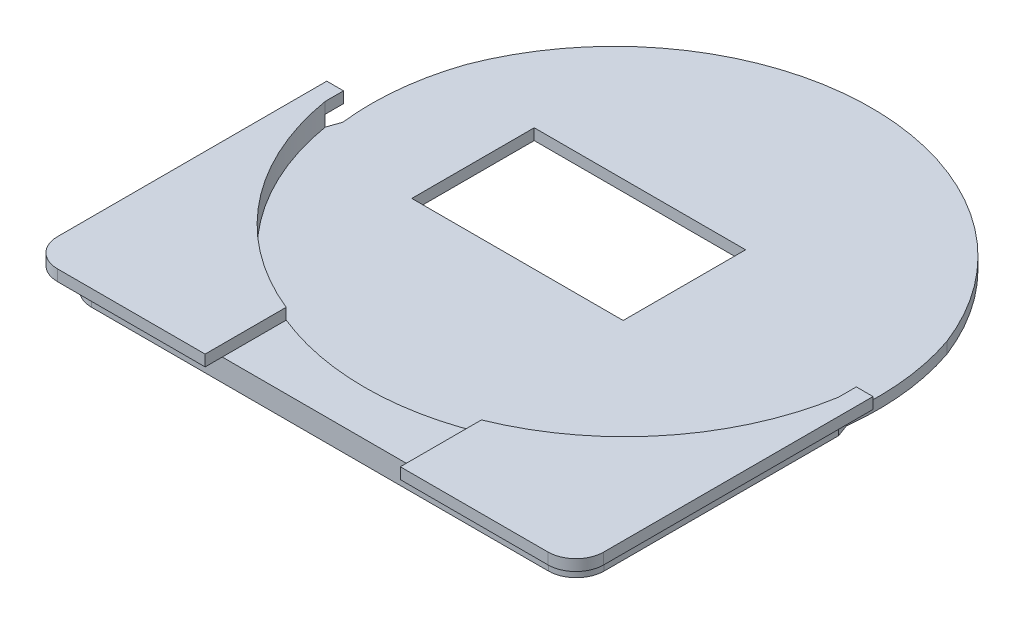
ISO-10303-21;
HEADER;
FILE_DESCRIPTION(('STEP AP214'),'2;1');
FILE_NAME('part.step','',(''),(''),'','','');
FILE_SCHEMA(('AUTOMOTIVE_DESIGN { 1 0 10303 214 1 1 1 1 }'));
ENDSEC;
DATA;
#1=APPLICATION_CONTEXT('core data for automotive mechanical design processes');
#2=APPLICATION_PROTOCOL_DEFINITION('international standard','automotive_design',2000,#1);
#3=PRODUCT_CONTEXT('',#1,'mechanical');
#4=PRODUCT('Part','Part','',(#3));
#5=PRODUCT_RELATED_PRODUCT_CATEGORY('part','',(#4));
#6=PRODUCT_DEFINITION_FORMATION('','',#4);
#7=PRODUCT_DEFINITION_CONTEXT('part definition',#1,'design');
#8=PRODUCT_DEFINITION('design','',#6,#7);
#9=PRODUCT_DEFINITION_SHAPE('','',#8);
#10=(LENGTH_UNIT() NAMED_UNIT(*) SI_UNIT(.MILLI.,.METRE.));
#11=(NAMED_UNIT(*) PLANE_ANGLE_UNIT() SI_UNIT($,.RADIAN.));
#12=(NAMED_UNIT(*) SI_UNIT($,.STERADIAN.) SOLID_ANGLE_UNIT());
#13=UNCERTAINTY_MEASURE_WITH_UNIT(LENGTH_MEASURE(1.E-05),#10,'distance_accuracy_value','');
#14=(GEOMETRIC_REPRESENTATION_CONTEXT(3) GLOBAL_UNCERTAINTY_ASSIGNED_CONTEXT((#13)) GLOBAL_UNIT_ASSIGNED_CONTEXT((#10,
#11,#12)) REPRESENTATION_CONTEXT('',''));
#15=CARTESIAN_POINT('',(0.,0.,0.));
#16=DIRECTION('',(0.,0.,1.));
#17=DIRECTION('',(1.,0.,0.));
#18=AXIS2_PLACEMENT_3D('',#15,#16,#17);
#19=CARTESIAN_POINT('',(-102.035735829472,4.,45.8580425502869));
#20=DIRECTION('',(0.,1.,0.));
#21=DIRECTION('',(0.,0.,1.));
#22=AXIS2_PLACEMENT_3D('',#19,#20,#21);
#23=PLANE('',#22);
#24=DIRECTION('',(1.,0.,0.));
#25=VECTOR('',#24,1.);
#26=CARTESIAN_POINT('',(-102.035735829472,4.,50.8580425502869));
#27=LINE('',#26,#25);
#28=CARTESIAN_POINT('',(-78.5477078121989,4.,50.8580425502869));
#29=VERTEX_POINT('',#28);
#30=CARTESIAN_POINT('',(-43.5307751661155,4.,50.8580425502869));
#31=VERTEX_POINT('',#30);
#32=EDGE_CURVE('E392',#29,#31,#27,.T.);
#33=ORIENTED_EDGE('',*,*,#32,.T.);
#34=DIRECTION('',(0.,0.,1.));
#35=VECTOR('',#34,1.);
#36=CARTESIAN_POINT('',(-43.5307751661155,4.,53.9393128759553));
#37=LINE('',#36,#35);
#38=CARTESIAN_POINT('',(-43.5307751661155,4.,39.3922849965716));
#39=VERTEX_POINT('',#38);
#40=EDGE_CURVE('E808',#39,#31,#37,.T.);
#41=ORIENTED_EDGE('',*,*,#40,.F.);
#42=CARTESIAN_POINT('',(-61.0392414891572,4.,-3.84195744971311));
#43=DIRECTION('',(0.,1.,0.));
#44=DIRECTION('',(0.,0.,1.));
#45=AXIS2_PLACEMENT_3D('',#42,#43,#44);
#46=CIRCLE('',#45,46.6448937493614);
#47=CARTESIAN_POINT('',(-78.5477078121989,4.,39.3922849965716));
#48=VERTEX_POINT('',#47);
#49=EDGE_CURVE('E366',#48,#39,#46,.T.);
#50=ORIENTED_EDGE('',*,*,#49,.F.);
#51=DIRECTION('',(0.,0.,-1.));
#52=VECTOR('',#51,1.);
#53=CARTESIAN_POINT('',(-78.5477078121989,4.,53.9393128759553));
#54=LINE('',#53,#52);
#55=EDGE_CURVE('E11',#29,#48,#54,.T.);
#56=ORIENTED_EDGE('',*,*,#55,.F.);
#57=EDGE_LOOP('',(#33,#41,#50,#56));
#58=FACE_BOUND('',#57,.T.);
#59=ADVANCED_FACE('F37',(#58),#23,.T.);
#60=CARTESIAN_POINT('',(-61.0357358294719,0.,-1.9398449355949));
#61=DIRECTION('',(0.,1.,0.));
#62=DIRECTION('',(0.,0.,1.));
#63=AXIS2_PLACEMENT_3D('',#60,#61,#62);
#64=CYLINDRICAL_SURFACE('',#63,46.1488583159595);
#65=DIRECTION('',(0.,1.,0.));
#66=VECTOR('',#65,1.);
#67=CARTESIAN_POINT('',(-104.132740842369,-3.,-18.4433379835776));
#68=LINE('',#67,#66);
#69=CARTESIAN_POINT('',(-104.132740842369,2.,-18.4433379835776));
#70=VERTEX_POINT('',#69);
#71=CARTESIAN_POINT('',(-104.132740842369,0.,-18.4433379835776));
#72=VERTEX_POINT('',#71);
#73=EDGE_CURVE('E335',#70,#72,#68,.F.);
#74=ORIENTED_EDGE('',*,*,#73,.F.);
#75=CARTESIAN_POINT('',(-61.0357358294719,2.,-1.9398449355949));
#76=DIRECTION('',(0.,1.,0.));
#77=DIRECTION('',(0.,0.,1.));
#78=AXIS2_PLACEMENT_3D('',#75,#76,#77);
#79=CIRCLE('',#78,46.1488583159595);
#80=CARTESIAN_POINT('',(-17.9998564170638,2.,-18.6020838928051));
#81=VERTEX_POINT('',#80);
#82=EDGE_CURVE('E425',#81,#70,#79,.T.);
#83=ORIENTED_EDGE('',*,*,#82,.F.);
#84=DIRECTION('',(0.,1.,0.));
#85=VECTOR('',#84,1.);
#86=CARTESIAN_POINT('',(-17.9998564170638,-3.,-18.6020838928051));
#87=LINE('',#86,#85);
#88=CARTESIAN_POINT('',(-17.9998564170638,0.,-18.6020838928051));
#89=VERTEX_POINT('',#88);
#90=EDGE_CURVE('E338',#89,#81,#87,.T.);
#91=ORIENTED_EDGE('',*,*,#90,.F.);
#92=CARTESIAN_POINT('',(-61.0357358294719,0.,-1.9398449355949));
#93=DIRECTION('',(0.,1.,0.));
#94=DIRECTION('',(0.,0.,1.));
#95=AXIS2_PLACEMENT_3D('',#92,#93,#94);
#96=CIRCLE('',#95,46.1488583159595);
#97=EDGE_CURVE('E422',#72,#89,#96,.F.);
#98=ORIENTED_EDGE('',*,*,#97,.F.);
#99=EDGE_LOOP('',(#74,#83,#91,#98));
#100=FACE_BOUND('',#99,.T.);
#101=ADVANCED_FACE('F445',(#100),#64,.T.);
#102=CARTESIAN_POINT('',(-102.035735829472,0.,45.8580425502869));
#103=DIRECTION('',(0.,1.,0.));
#104=DIRECTION('',(0.,0.,1.));
#105=AXIS2_PLACEMENT_3D('',#102,#103,#104);
#106=PLANE('',#105);
#107=DIRECTION('',(1.,0.,0.));
#108=VECTOR('',#107,1.);
#109=CARTESIAN_POINT('',(-50.2680723261196,0.,7.2220291908083));
#110=LINE('',#109,#108);
#111=CARTESIAN_POINT('',(-88.1898360293224,0.,7.2220291908083));
#112=VERTEX_POINT('',#111);
#113=CARTESIAN_POINT('',(-50.2680723261196,0.,7.2220291908083));
#114=VERTEX_POINT('',#113);
#115=EDGE_CURVE('E351',#112,#114,#110,.T.);
#116=ORIENTED_EDGE('',*,*,#115,.T.);
#117=DIRECTION('',(0.,0.,-1.));
#118=VECTOR('',#117,1.);
#119=CARTESIAN_POINT('',(-50.2680723261196,0.,-14.7440043560306));
#120=LINE('',#119,#118);
#121=CARTESIAN_POINT('',(-50.2680723261196,0.,-14.7440043560306));
#122=VERTEX_POINT('',#121);
#123=EDGE_CURVE('E341',#114,#122,#120,.T.);
#124=ORIENTED_EDGE('',*,*,#123,.T.);
#125=DIRECTION('',(-1.,0.,0.));
#126=VECTOR('',#125,1.);
#127=CARTESIAN_POINT('',(-50.2680723261196,0.,-14.7440043560306));
#128=LINE('',#127,#126);
#129=CARTESIAN_POINT('',(-88.1898360293224,0.,-14.7440043560306));
#130=VERTEX_POINT('',#129);
#131=EDGE_CURVE('E344',#122,#130,#128,.T.);
#132=ORIENTED_EDGE('',*,*,#131,.T.);
#133=DIRECTION('',(0.,0.,1.));
#134=VECTOR('',#133,1.);
#135=CARTESIAN_POINT('',(-88.1898360293224,0.,-14.7440043560306));
#136=LINE('',#135,#134);
#137=EDGE_CURVE('E348',#130,#112,#136,.T.);
#138=ORIENTED_EDGE('',*,*,#137,.T.);
#139=EDGE_LOOP('',(#116,#124,#132,#138));
#140=FACE_BOUND('',#139,.T.);
#141=CARTESIAN_POINT('',(-61.0392414891572,0.,-3.84195744971311));
#142=DIRECTION('',(0.,1.,0.));
#143=DIRECTION('',(0.,0.,1.));
#144=AXIS2_PLACEMENT_3D('',#141,#142,#143);
#145=CIRCLE('',#144,45.5);
#146=CARTESIAN_POINT('',(-106.217317024172,0.,1.56095759241559));
#147=VERTEX_POINT('',#146);
#148=EDGE_CURVE('E333',#72,#147,#145,.T.);
#149=ORIENTED_EDGE('',*,*,#148,.F.);
#150=ORIENTED_EDGE('',*,*,#97,.T.);
#151=CARTESIAN_POINT('',(-15.861165954142,0.,1.56095759241558));
#152=VERTEX_POINT('',#151);
#153=EDGE_CURVE('E336',#152,#89,#145,.T.);
#154=ORIENTED_EDGE('',*,*,#153,.F.);
#155=DIRECTION('',(0.343698835821301,0.,0.939079927511542));
#156=VECTOR('',#155,1.);
#157=CARTESIAN_POINT('',(-11.743515050915,0.,12.8115145007046));
#158=LINE('',#157,#156);
#159=CARTESIAN_POINT('',(-15.0357358294719,0.,3.81626014468849));
#160=VERTEX_POINT('',#159);
#161=EDGE_CURVE('E322',#152,#160,#158,.T.);
#162=ORIENTED_EDGE('',*,*,#161,.T.);
#163=DIRECTION('',(0.,0.,-1.));
#164=VECTOR('',#163,1.);
#165=CARTESIAN_POINT('',(-15.0357358294719,0.,-49.1419574497131));
#166=LINE('',#165,#164);
#167=CARTESIAN_POINT('',(-15.0357358294719,0.,45.8580425502868));
#168=VERTEX_POINT('',#167);
#169=EDGE_CURVE('E389',#168,#160,#166,.T.);
#170=ORIENTED_EDGE('',*,*,#169,.F.);
#171=CARTESIAN_POINT('',(-20.0357358294719,0.,45.8580425502869));
#172=DIRECTION('',(0.,1.,0.));
#173=DIRECTION('',(0.,0.,1.));
#174=AXIS2_PLACEMENT_3D('',#171,#172,#173);
#175=CIRCLE('',#174,5.);
#176=CARTESIAN_POINT('',(-20.035735829472,0.,50.8580425502869));
#177=VERTEX_POINT('',#176);
#178=EDGE_CURVE('E407',#177,#168,#175,.T.);
#179=ORIENTED_EDGE('',*,*,#178,.F.);
#180=DIRECTION('',(1.,0.,0.));
#181=VECTOR('',#180,1.);
#182=CARTESIAN_POINT('',(-102.035735829472,0.,50.8580425502869));
#183=LINE('',#182,#181);
#184=CARTESIAN_POINT('',(-102.035735829472,0.,50.8580425502869));
#185=VERTEX_POINT('',#184);
#186=EDGE_CURVE('E405',#185,#177,#183,.T.);
#187=ORIENTED_EDGE('',*,*,#186,.F.);
#188=CARTESIAN_POINT('',(-102.035735829472,0.,45.8580425502869));
#189=DIRECTION('',(0.,1.,0.));
#190=DIRECTION('',(0.,0.,1.));
#191=AXIS2_PLACEMENT_3D('',#188,#189,#190);
#192=CIRCLE('',#191,5.);
#193=CARTESIAN_POINT('',(-107.035735829472,0.,45.8580425502868));
#194=VERTEX_POINT('',#193);
#195=EDGE_CURVE('E403',#194,#185,#192,.T.);
#196=ORIENTED_EDGE('',*,*,#195,.F.);
#197=DIRECTION('',(0.,0.,1.));
#198=VECTOR('',#197,1.);
#199=CARTESIAN_POINT('',(-107.035735829472,0.,-49.1419574497131));
#200=LINE('',#199,#198);
#201=CARTESIAN_POINT('',(-107.035735829472,0.,3.90843746220008));
#202=VERTEX_POINT('',#201);
#203=EDGE_CURVE('E384',#202,#194,#200,.T.);
#204=ORIENTED_EDGE('',*,*,#203,.F.);
#205=DIRECTION('',(-0.329203777971666,0.,0.944258901239052));
#206=VECTOR('',#205,1.);
#207=CARTESIAN_POINT('',(-119.534045854839,0.,39.7574807648366));
#208=LINE('',#207,#206);
#209=EDGE_CURVE('E331',#147,#202,#208,.T.);
#210=ORIENTED_EDGE('',*,*,#209,.F.);
#211=EDGE_LOOP('',(#149,#150,#154,#162,#170,#179,#187,#196,#204,#210));
#212=FACE_BOUND('',#211,.T.);
#213=ADVANCED_FACE('F449',(#140,#212),#106,.F.);
#214=CARTESIAN_POINT('',(-107.035735829472,4.,-49.1419574497131));
#215=DIRECTION('',(1.,0.,0.));
#216=DIRECTION('',(0.,0.,-1.));
#217=AXIS2_PLACEMENT_3D('',#214,#215,#216);
#218=PLANE('',#217);
#219=DIRECTION('',(0.,1.,0.));
#220=VECTOR('',#219,1.);
#221=CARTESIAN_POINT('',(-107.035735829472,-8.,3.90843746220008));
#222=LINE('',#221,#220);
#223=CARTESIAN_POINT('',(-107.035735829472,2.,3.90843746220009));
#224=VERTEX_POINT('',#223);
#225=EDGE_CURVE('E323',#202,#224,#222,.T.);
#226=ORIENTED_EDGE('',*,*,#225,.F.);
#227=ORIENTED_EDGE('',*,*,#203,.T.);
#228=DIRECTION('',(0.,-1.,0.));
#229=VECTOR('',#228,1.);
#230=CARTESIAN_POINT('',(-107.035735829472,4.,45.8580425502868));
#231=LINE('',#230,#229);
#232=CARTESIAN_POINT('',(-107.035735829472,4.,45.8580425502868));
#233=VERTEX_POINT('',#232);
#234=EDGE_CURVE('E419',#233,#194,#231,.T.);
#235=ORIENTED_EDGE('',*,*,#234,.F.);
#236=DIRECTION('',(0.,0.,1.));
#237=VECTOR('',#236,1.);
#238=CARTESIAN_POINT('',(-107.035735829472,4.,-49.1419574497131));
#239=LINE('',#238,#237);
#240=CARTESIAN_POINT('',(-107.035735829472,4.,3.90843746220009));
#241=VERTEX_POINT('',#240);
#242=EDGE_CURVE('E385',#241,#233,#239,.T.);
#243=ORIENTED_EDGE('',*,*,#242,.F.);
#244=DIRECTION('',(0.,1.,0.));
#245=VECTOR('',#244,1.);
#246=CARTESIAN_POINT('',(-107.035735829472,2.,3.90843746220009));
#247=LINE('',#246,#245);
#248=EDGE_CURVE('E381',#241,#224,#247,.F.);
#249=ORIENTED_EDGE('',*,*,#248,.T.);
#250=EDGE_LOOP('',(#226,#227,#235,#243,#249));
#251=FACE_BOUND('',#250,.T.);
#252=ADVANCED_FACE('F39',(#251),#218,.F.);
#253=CARTESIAN_POINT('',(-61.0392414891572,2.,-3.84195744971311));
#254=DIRECTION('',(0.,1.,0.));
#255=DIRECTION('',(0.,0.,1.));
#256=AXIS2_PLACEMENT_3D('',#253,#254,#255);
#257=PLANE('',#256);
#258=DIRECTION('',(0.,0.,-1.));
#259=VECTOR('',#258,1.);
#260=CARTESIAN_POINT('',(-50.2680723261196,2.,-14.7440043560306));
#261=LINE('',#260,#259);
#262=CARTESIAN_POINT('',(-50.2680723261196,2.,7.2220291908083));
#263=VERTEX_POINT('',#262);
#264=CARTESIAN_POINT('',(-50.2680723261196,2.,-14.7440043560306));
#265=VERTEX_POINT('',#264);
#266=EDGE_CURVE('E340',#263,#265,#261,.T.);
#267=ORIENTED_EDGE('',*,*,#266,.F.);
#268=DIRECTION('',(1.,0.,0.));
#269=VECTOR('',#268,1.);
#270=CARTESIAN_POINT('',(-50.2680723261196,2.,7.2220291908083));
#271=LINE('',#270,#269);
#272=CARTESIAN_POINT('',(-88.1898360293224,2.,7.2220291908083));
#273=VERTEX_POINT('',#272);
#274=EDGE_CURVE('E345',#273,#263,#271,.T.);
#275=ORIENTED_EDGE('',*,*,#274,.F.);
#276=DIRECTION('',(0.,0.,1.));
#277=VECTOR('',#276,1.);
#278=CARTESIAN_POINT('',(-88.1898360293224,2.,-14.7440043560306));
#279=LINE('',#278,#277);
#280=CARTESIAN_POINT('',(-88.1898360293224,2.,-14.7440043560306));
#281=VERTEX_POINT('',#280);
#282=EDGE_CURVE('E359',#281,#273,#279,.T.);
#283=ORIENTED_EDGE('',*,*,#282,.F.);
#284=DIRECTION('',(-1.,0.,0.));
#285=VECTOR('',#284,1.);
#286=CARTESIAN_POINT('',(-50.2680723261196,2.,-14.7440043560306));
#287=LINE('',#286,#285);
#288=EDGE_CURVE('E356',#265,#281,#287,.T.);
#289=ORIENTED_EDGE('',*,*,#288,.F.);
#290=EDGE_LOOP('',(#267,#275,#283,#289));
#291=FACE_BOUND('',#290,.T.);
#292=ORIENTED_EDGE('',*,*,#82,.T.);
#293=CARTESIAN_POINT('',(-61.0392414891572,2.,-3.84195744971311));
#294=DIRECTION('',(0.,1.,0.));
#295=DIRECTION('',(0.,0.,1.));
#296=AXIS2_PLACEMENT_3D('',#293,#294,#295);
#297=CIRCLE('',#296,45.5);
#298=CARTESIAN_POINT('',(-106.217317024172,2.,1.56095759241559));
#299=VERTEX_POINT('',#298);
#300=EDGE_CURVE('E41',#70,#299,#297,.T.);
#301=ORIENTED_EDGE('',*,*,#300,.T.);
#302=DIRECTION('',(-0.329203777971666,0.,0.944258901239052));
#303=VECTOR('',#302,1.);
#304=CARTESIAN_POINT('',(-94.2207724729035,2.,-32.8488661539617));
#305=LINE('',#304,#303);
#306=EDGE_CURVE('E316',#299,#224,#305,.T.);
#307=ORIENTED_EDGE('',*,*,#306,.T.);
#308=CARTESIAN_POINT('',(-61.0392414891572,2.,-3.84195744971311));
#309=DIRECTION('',(0.,1.,0.));
#310=DIRECTION('',(0.,0.,1.));
#311=AXIS2_PLACEMENT_3D('',#308,#309,#310);
#312=CIRCLE('',#311,46.6448937493614);
#313=CARTESIAN_POINT('',(-15.0357358294719,2.,3.86671169019128));
#314=VERTEX_POINT('',#313);
#315=EDGE_CURVE('E373',#224,#314,#312,.T.);
#316=ORIENTED_EDGE('',*,*,#315,.T.);
#317=DIRECTION('',(0.,0.,-1.));
#318=VECTOR('',#317,1.);
#319=CARTESIAN_POINT('',(-15.0357358294719,2.,-49.1419574497131));
#320=LINE('',#319,#318);
#321=CARTESIAN_POINT('',(-15.0357358294719,2.,3.81626014468849));
#322=VERTEX_POINT('',#321);
#323=EDGE_CURVE('E376',#314,#322,#320,.T.);
#324=ORIENTED_EDGE('',*,*,#323,.T.);
#325=DIRECTION('',(0.343698835821301,0.,0.939079927511542));
#326=VECTOR('',#325,1.);
#327=CARTESIAN_POINT('',(-14.4913197605095,2.,5.303754861846));
#328=LINE('',#327,#326);
#329=CARTESIAN_POINT('',(-15.861165954142,2.,1.56095759241558));
#330=VERTEX_POINT('',#329);
#331=EDGE_CURVE('E314',#330,#322,#328,.T.);
#332=ORIENTED_EDGE('',*,*,#331,.F.);
#333=CARTESIAN_POINT('',(-61.0392414891572,2.,-3.84195744971311));
#334=DIRECTION('',(0.,1.,0.));
#335=DIRECTION('',(0.,0.,1.));
#336=AXIS2_PLACEMENT_3D('',#333,#334,#335);
#337=CIRCLE('',#336,45.5);
#338=EDGE_CURVE('E60',#330,#81,#337,.T.);
#339=ORIENTED_EDGE('',*,*,#338,.T.);
#340=EDGE_LOOP('',(#292,#301,#307,#316,#324,#332,#339));
#341=FACE_BOUND('',#340,.T.);
#342=ADVANCED_FACE('F434',(#291,#341),#257,.T.);
#343=CARTESIAN_POINT('',(-102.035735829472,4.,45.8580425502869));
#344=DIRECTION('',(0.,-1.,0.));
#345=DIRECTION('',(0.,0.,-1.));
#346=AXIS2_PLACEMENT_3D('',#343,#344,#345);
#347=CYLINDRICAL_SURFACE('',#346,5.);
#348=ORIENTED_EDGE('',*,*,#195,.T.);
#349=DIRECTION('',(0.,-1.,0.));
#350=VECTOR('',#349,1.);
#351=CARTESIAN_POINT('',(-102.035735829472,4.,50.8580425502869));
#352=LINE('',#351,#350);
#353=CARTESIAN_POINT('',(-102.035735829472,4.,50.8580425502869));
#354=VERTEX_POINT('',#353);
#355=EDGE_CURVE('E416',#354,#185,#352,.T.);
#356=ORIENTED_EDGE('',*,*,#355,.F.);
#357=CARTESIAN_POINT('',(-102.035735829472,4.,45.8580425502869));
#358=DIRECTION('',(0.,1.,0.));
#359=DIRECTION('',(0.,0.,1.));
#360=AXIS2_PLACEMENT_3D('',#357,#358,#359);
#361=CIRCLE('',#360,5.);
#362=EDGE_CURVE('E388',#233,#354,#361,.T.);
#363=ORIENTED_EDGE('',*,*,#362,.F.);
#364=ORIENTED_EDGE('',*,*,#234,.T.);
#365=EDGE_LOOP('',(#348,#356,#363,#364));
#366=FACE_BOUND('',#365,.T.);
#367=ADVANCED_FACE('F462',(#366),#347,.T.);
#368=CARTESIAN_POINT('',(-102.035735829472,4.,50.8580425502869));
#369=DIRECTION('',(0.,0.,-1.));
#370=DIRECTION('',(-1.,0.,0.));
#371=AXIS2_PLACEMENT_3D('',#368,#369,#370);
#372=PLANE('',#371);
#373=ORIENTED_EDGE('',*,*,#186,.T.);
#374=DIRECTION('',(0.,-1.,0.));
#375=VECTOR('',#374,1.);
#376=CARTESIAN_POINT('',(-20.035735829472,4.,50.8580425502869));
#377=LINE('',#376,#375);
#378=CARTESIAN_POINT('',(-20.0357358294719,4.,50.8580425502869));
#379=VERTEX_POINT('',#378);
#380=EDGE_CURVE('E413',#379,#177,#377,.T.);
#381=ORIENTED_EDGE('',*,*,#380,.F.);
#382=DIRECTION('',(1.,0.,0.));
#383=VECTOR('',#382,1.);
#384=CARTESIAN_POINT('',(-102.035735829472,4.,50.8580425502869));
#385=LINE('',#384,#383);
#386=EDGE_CURVE('E258',#31,#379,#385,.T.);
#387=ORIENTED_EDGE('',*,*,#386,.F.);
#388=ORIENTED_EDGE('',*,*,#32,.F.);
#389=EDGE_CURVE('E393',#354,#29,#27,.T.);
#390=ORIENTED_EDGE('',*,*,#389,.F.);
#391=ORIENTED_EDGE('',*,*,#355,.T.);
#392=EDGE_LOOP('',(#373,#381,#387,#388,#390,#391));
#393=FACE_BOUND('',#392,.T.);
#394=ADVANCED_FACE('F504',(#393),#372,.F.);
#395=CARTESIAN_POINT('',(-20.0357358294719,4.,45.8580425502869));
#396=DIRECTION('',(0.,-1.,0.));
#397=DIRECTION('',(0.,0.,-1.));
#398=AXIS2_PLACEMENT_3D('',#395,#396,#397);
#399=CYLINDRICAL_SURFACE('',#398,5.);
#400=ORIENTED_EDGE('',*,*,#178,.T.);
#401=DIRECTION('',(0.,-1.,0.));
#402=VECTOR('',#401,1.);
#403=CARTESIAN_POINT('',(-15.0357358294719,4.,45.8580425502868));
#404=LINE('',#403,#402);
#405=CARTESIAN_POINT('',(-15.0357358294719,4.,45.8580425502869));
#406=VERTEX_POINT('',#405);
#407=EDGE_CURVE('E401',#406,#168,#404,.T.);
#408=ORIENTED_EDGE('',*,*,#407,.F.);
#409=CARTESIAN_POINT('',(-20.0357358294719,4.,45.8580425502869));
#410=DIRECTION('',(0.,1.,0.));
#411=DIRECTION('',(0.,0.,1.));
#412=AXIS2_PLACEMENT_3D('',#409,#410,#411);
#413=CIRCLE('',#412,5.);
#414=EDGE_CURVE('E396',#379,#406,#413,.T.);
#415=ORIENTED_EDGE('',*,*,#414,.F.);
#416=ORIENTED_EDGE('',*,*,#380,.T.);
#417=EDGE_LOOP('',(#400,#408,#415,#416));
#418=FACE_BOUND('',#417,.T.);
#419=ADVANCED_FACE('F493',(#418),#399,.T.);
#420=CARTESIAN_POINT('',(-15.0357358294719,4.,-49.1419574497131));
#421=DIRECTION('',(-1.,0.,0.));
#422=DIRECTION('',(0.,0.,1.));
#423=AXIS2_PLACEMENT_3D('',#420,#421,#422);
#424=PLANE('',#423);
#425=ORIENTED_EDGE('',*,*,#169,.T.);
#426=DIRECTION('',(0.,1.,0.));
#427=VECTOR('',#426,1.);
#428=CARTESIAN_POINT('',(-15.0357358294719,-8.,3.81626014468849));
#429=LINE('',#428,#427);
#430=EDGE_CURVE('E325',#160,#322,#429,.T.);
#431=ORIENTED_EDGE('',*,*,#430,.T.);
#432=ORIENTED_EDGE('',*,*,#323,.F.);
#433=DIRECTION('',(0.,1.,0.));
#434=VECTOR('',#433,1.);
#435=CARTESIAN_POINT('',(-15.0357358294719,2.,3.86671169019128));
#436=LINE('',#435,#434);
#437=CARTESIAN_POINT('',(-15.0357358294719,4.,3.86671169019128));
#438=VERTEX_POINT('',#437);
#439=EDGE_CURVE('E427',#314,#438,#436,.T.);
#440=ORIENTED_EDGE('',*,*,#439,.T.);
#441=DIRECTION('',(0.,0.,-1.));
#442=VECTOR('',#441,1.);
#443=CARTESIAN_POINT('',(-15.0357358294719,4.,-49.1419574497131));
#444=LINE('',#443,#442);
#445=EDGE_CURVE('E398',#406,#438,#444,.T.);
#446=ORIENTED_EDGE('',*,*,#445,.F.);
#447=ORIENTED_EDGE('',*,*,#407,.T.);
#448=EDGE_LOOP('',(#425,#431,#432,#440,#446,#447));
#449=FACE_BOUND('',#448,.T.);
#450=ADVANCED_FACE('F487',(#449),#424,.F.);
#451=CARTESIAN_POINT('',(-61.0392414891572,2.,-3.84195744971311));
#452=DIRECTION('',(0.,1.,0.));
#453=DIRECTION('',(0.,0.,1.));
#454=AXIS2_PLACEMENT_3D('',#451,#452,#453);
#455=CYLINDRICAL_SURFACE('',#454,46.6448937493614);
#456=ORIENTED_EDGE('',*,*,#248,.F.);
#457=DIRECTION('',(0.,-1.,0.));
#458=VECTOR('',#457,1.);
#459=CARTESIAN_POINT('',(-107.035735829472,6.,3.90843746220009));
#460=LINE('',#459,#458);
#461=CARTESIAN_POINT('',(-107.035735829472,6.,3.90843746220009));
#462=VERTEX_POINT('',#461);
#463=EDGE_CURVE('E298',#462,#241,#460,.T.);
#464=ORIENTED_EDGE('',*,*,#463,.F.);
#465=CARTESIAN_POINT('',(-61.0392414891572,6.,-3.84195744971312));
#466=DIRECTION('',(0.,-1.,0.));
#467=DIRECTION('',(0.,0.,1.));
#468=AXIS2_PLACEMENT_3D('',#465,#466,#467);
#469=CIRCLE('',#468,46.6448937493614);
#470=CARTESIAN_POINT('',(-78.5477078121989,6.,39.3922849965716));
#471=VERTEX_POINT('',#470);
#472=EDGE_CURVE('E276',#471,#462,#469,.T.);
#473=ORIENTED_EDGE('',*,*,#472,.F.);
#474=DIRECTION('',(0.,-1.,0.));
#475=VECTOR('',#474,1.);
#476=CARTESIAN_POINT('',(-78.5477078121989,6.,39.3922849965716));
#477=LINE('',#476,#475);
#478=EDGE_CURVE('E301',#471,#48,#477,.T.);
#479=ORIENTED_EDGE('',*,*,#478,.T.);
#480=ORIENTED_EDGE('',*,*,#49,.T.);
#481=DIRECTION('',(0.,-1.,0.));
#482=VECTOR('',#481,1.);
#483=CARTESIAN_POINT('',(-43.5307751661155,6.,39.3922849965716));
#484=LINE('',#483,#482);
#485=CARTESIAN_POINT('',(-43.5307751661155,6.,39.3922849965716));
#486=VERTEX_POINT('',#485);
#487=EDGE_CURVE('E262',#486,#39,#484,.T.);
#488=ORIENTED_EDGE('',*,*,#487,.F.);
#489=CARTESIAN_POINT('',(-61.0392414891572,6.,-3.84195744971312));
#490=DIRECTION('',(0.,-1.,0.));
#491=DIRECTION('',(0.,0.,1.));
#492=AXIS2_PLACEMENT_3D('',#489,#490,#491);
#493=CIRCLE('',#492,46.6448937493614);
#494=CARTESIAN_POINT('',(-15.0357358294719,6.,3.86671169019127));
#495=VERTEX_POINT('',#494);
#496=EDGE_CURVE('E243',#495,#486,#493,.T.);
#497=ORIENTED_EDGE('',*,*,#496,.F.);
#498=DIRECTION('',(0.,-1.,0.));
#499=VECTOR('',#498,1.);
#500=CARTESIAN_POINT('',(-15.0357358294719,6.,3.86671169019127));
#501=LINE('',#500,#499);
#502=EDGE_CURVE('E240',#495,#438,#501,.T.);
#503=ORIENTED_EDGE('',*,*,#502,.T.);
#504=ORIENTED_EDGE('',*,*,#439,.F.);
#505=ORIENTED_EDGE('',*,*,#315,.F.);
#506=EDGE_LOOP('',(#456,#464,#473,#479,#480,#488,#497,#503,#504,#505));
#507=FACE_BOUND('',#506,.T.);
#508=ADVANCED_FACE('F485',(#507),#455,.F.);
#509=CARTESIAN_POINT('',(-50.2680723261196,0.,-14.7440043560306));
#510=DIRECTION('',(1.,0.,0.));
#511=DIRECTION('',(0.,0.,-1.));
#512=AXIS2_PLACEMENT_3D('',#509,#510,#511);
#513=PLANE('',#512);
#514=ORIENTED_EDGE('',*,*,#266,.T.);
#515=DIRECTION('',(0.,1.,0.));
#516=VECTOR('',#515,1.);
#517=CARTESIAN_POINT('',(-50.2680723261196,0.,-14.7440043560306));
#518=LINE('',#517,#516);
#519=EDGE_CURVE('E354',#122,#265,#518,.T.);
#520=ORIENTED_EDGE('',*,*,#519,.F.);
#521=ORIENTED_EDGE('',*,*,#123,.F.);
#522=DIRECTION('',(0.,1.,0.));
#523=VECTOR('',#522,1.);
#524=CARTESIAN_POINT('',(-50.2680723261196,0.,7.2220291908083));
#525=LINE('',#524,#523);
#526=EDGE_CURVE('E364',#114,#263,#525,.T.);
#527=ORIENTED_EDGE('',*,*,#526,.T.);
#528=EDGE_LOOP('',(#514,#520,#521,#527));
#529=FACE_BOUND('',#528,.T.);
#530=ADVANCED_FACE('F555',(#529),#513,.F.);
#531=CARTESIAN_POINT('',(-50.2680723261196,0.,7.2220291908083));
#532=DIRECTION('',(0.,0.,1.));
#533=DIRECTION('',(1.,0.,0.));
#534=AXIS2_PLACEMENT_3D('',#531,#532,#533);
#535=PLANE('',#534);
#536=ORIENTED_EDGE('',*,*,#274,.T.);
#537=ORIENTED_EDGE('',*,*,#526,.F.);
#538=ORIENTED_EDGE('',*,*,#115,.F.);
#539=DIRECTION('',(0.,1.,0.));
#540=VECTOR('',#539,1.);
#541=CARTESIAN_POINT('',(-88.1898360293224,0.,7.2220291908083));
#542=LINE('',#541,#540);
#543=EDGE_CURVE('E367',#112,#273,#542,.T.);
#544=ORIENTED_EDGE('',*,*,#543,.T.);
#545=EDGE_LOOP('',(#536,#537,#538,#544));
#546=FACE_BOUND('',#545,.T.);
#547=ADVANCED_FACE('F561',(#546),#535,.F.);
#548=CARTESIAN_POINT('',(-88.1898360293224,0.,-14.7440043560306));
#549=DIRECTION('',(-1.,0.,0.));
#550=DIRECTION('',(0.,0.,1.));
#551=AXIS2_PLACEMENT_3D('',#548,#549,#550);
#552=PLANE('',#551);
#553=ORIENTED_EDGE('',*,*,#282,.T.);
#554=ORIENTED_EDGE('',*,*,#543,.F.);
#555=ORIENTED_EDGE('',*,*,#137,.F.);
#556=DIRECTION('',(0.,1.,0.));
#557=VECTOR('',#556,1.);
#558=CARTESIAN_POINT('',(-88.1898360293224,0.,-14.7440043560306));
#559=LINE('',#558,#557);
#560=EDGE_CURVE('E369',#130,#281,#559,.T.);
#561=ORIENTED_EDGE('',*,*,#560,.T.);
#562=EDGE_LOOP('',(#553,#554,#555,#561));
#563=FACE_BOUND('',#562,.T.);
#564=ADVANCED_FACE('F566',(#563),#552,.F.);
#565=CARTESIAN_POINT('',(-50.2680723261196,0.,-14.7440043560306));
#566=DIRECTION('',(0.,0.,-1.));
#567=DIRECTION('',(-1.,0.,0.));
#568=AXIS2_PLACEMENT_3D('',#565,#566,#567);
#569=PLANE('',#568);
#570=ORIENTED_EDGE('',*,*,#288,.T.);
#571=ORIENTED_EDGE('',*,*,#560,.F.);
#572=ORIENTED_EDGE('',*,*,#131,.F.);
#573=ORIENTED_EDGE('',*,*,#519,.T.);
#574=EDGE_LOOP('',(#570,#571,#572,#573));
#575=FACE_BOUND('',#574,.T.);
#576=ADVANCED_FACE('F574',(#575),#569,.F.);
#577=CARTESIAN_POINT('',(-14.4913197605095,-8.,5.303754861846));
#578=DIRECTION('',(-0.939079927511542,0.,0.343698835821301));
#579=DIRECTION('',(0.343698835821301,0.,0.939079927511542));
#580=AXIS2_PLACEMENT_3D('',#577,#578,#579);
#581=PLANE('',#580);
#582=DIRECTION('',(0.,1.,0.));
#583=VECTOR('',#582,1.);
#584=CARTESIAN_POINT('',(-15.861165954142,-8.,1.56095759241558));
#585=LINE('',#584,#583);
#586=EDGE_CURVE('E319',#152,#330,#585,.T.);
#587=ORIENTED_EDGE('',*,*,#586,.T.);
#588=ORIENTED_EDGE('',*,*,#331,.T.);
#589=ORIENTED_EDGE('',*,*,#430,.F.);
#590=ORIENTED_EDGE('',*,*,#161,.F.);
#591=EDGE_LOOP('',(#587,#588,#589,#590));
#592=FACE_BOUND('',#591,.T.);
#593=ADVANCED_FACE('F490',(#592),#581,.F.);
#594=CARTESIAN_POINT('',(-61.0392414891572,-8.,-3.84195744971311));
#595=DIRECTION('',(0.,1.,0.));
#596=DIRECTION('',(0.,0.,1.));
#597=AXIS2_PLACEMENT_3D('',#594,#595,#596);
#598=CYLINDRICAL_SURFACE('',#597,45.5);
#599=ORIENTED_EDGE('',*,*,#90,.T.);
#600=ORIENTED_EDGE('',*,*,#338,.F.);
#601=ORIENTED_EDGE('',*,*,#586,.F.);
#602=ORIENTED_EDGE('',*,*,#153,.T.);
#603=EDGE_LOOP('',(#599,#600,#601,#602));
#604=FACE_BOUND('',#603,.T.);
#605=ADVANCED_FACE('F585',(#604),#598,.T.);
#606=ORIENTED_EDGE('',*,*,#73,.T.);
#607=ORIENTED_EDGE('',*,*,#148,.T.);
#608=DIRECTION('',(0.,1.,0.));
#609=VECTOR('',#608,1.);
#610=CARTESIAN_POINT('',(-106.217317024172,-8.,1.56095759241559));
#611=LINE('',#610,#609);
#612=EDGE_CURVE('E320',#147,#299,#611,.T.);
#613=ORIENTED_EDGE('',*,*,#612,.T.);
#614=ORIENTED_EDGE('',*,*,#300,.F.);
#615=EDGE_LOOP('',(#606,#607,#613,#614));
#616=FACE_BOUND('',#615,.T.);
#617=ADVANCED_FACE('F440',(#616),#598,.T.);
#618=CARTESIAN_POINT('',(-94.2207724729035,-8.,-32.8488661539617));
#619=DIRECTION('',(-0.944258901239052,0.,-0.329203777971666));
#620=DIRECTION('',(-0.329203777971666,0.,0.944258901239052));
#621=AXIS2_PLACEMENT_3D('',#618,#619,#620);
#622=PLANE('',#621);
#623=ORIENTED_EDGE('',*,*,#209,.T.);
#624=ORIENTED_EDGE('',*,*,#225,.T.);
#625=ORIENTED_EDGE('',*,*,#306,.F.);
#626=ORIENTED_EDGE('',*,*,#612,.F.);
#627=EDGE_LOOP('',(#623,#624,#625,#626));
#628=FACE_BOUND('',#627,.T.);
#629=ADVANCED_FACE('F453',(#628),#622,.T.);
#630=CARTESIAN_POINT('',(-105.035735829472,4.,48.9393128759553));
#631=DIRECTION('',(0.,1.,0.));
#632=DIRECTION('',(0.,0.,1.));
#633=AXIS2_PLACEMENT_3D('',#630,#631,#632);
#634=PLANE('',#633);
#635=DIRECTION('',(0.,0.,-1.));
#636=VECTOR('',#635,1.);
#637=CARTESIAN_POINT('',(-107.035735829472,4.,3.90843746220009));
#638=LINE('',#637,#636);
#639=CARTESIAN_POINT('',(-107.035735829472,4.,0.626443870858271));
#640=VERTEX_POINT('',#639);
#641=EDGE_CURVE('E290',#241,#640,#638,.T.);
#642=ORIENTED_EDGE('',*,*,#641,.F.);
#643=ORIENTED_EDGE('',*,*,#242,.T.);
#644=ORIENTED_EDGE('',*,*,#362,.T.);
#645=ORIENTED_EDGE('',*,*,#389,.T.);
#646=CARTESIAN_POINT('',(-78.5477078121989,4.,53.9393128759553));
#647=VERTEX_POINT('',#646);
#648=EDGE_CURVE('E47',#647,#29,#54,.T.);
#649=ORIENTED_EDGE('',*,*,#648,.F.);
#650=DIRECTION('',(1.,0.,0.));
#651=VECTOR('',#650,1.);
#652=CARTESIAN_POINT('',(-105.035735829472,4.,53.9393128759553));
#653=LINE('',#652,#651);
#654=CARTESIAN_POINT('',(-105.035735829472,4.,53.9393128759553));
#655=VERTEX_POINT('',#654);
#656=EDGE_CURVE('E287',#655,#647,#653,.T.);
#657=ORIENTED_EDGE('',*,*,#656,.F.);
#658=CARTESIAN_POINT('',(-105.035735829472,4.,48.9393128759553));
#659=DIRECTION('',(0.,1.,0.));
#660=DIRECTION('',(0.,0.,1.));
#661=AXIS2_PLACEMENT_3D('',#658,#659,#660);
#662=CIRCLE('',#661,5.);
#663=CARTESIAN_POINT('',(-110.035735829472,4.,48.9393128759553));
#664=VERTEX_POINT('',#663);
#665=EDGE_CURVE('E285',#664,#655,#662,.T.);
#666=ORIENTED_EDGE('',*,*,#665,.F.);
#667=DIRECTION('',(0.,0.,1.));
#668=VECTOR('',#667,1.);
#669=CARTESIAN_POINT('',(-110.035735829472,4.,0.626443870858271));
#670=LINE('',#669,#668);
#671=CARTESIAN_POINT('',(-110.035735829472,4.,0.626443870858271));
#672=VERTEX_POINT('',#671);
#673=EDGE_CURVE('E260',#672,#664,#670,.T.);
#674=ORIENTED_EDGE('',*,*,#673,.F.);
#675=DIRECTION('',(-1.,0.,0.));
#676=VECTOR('',#675,1.);
#677=CARTESIAN_POINT('',(-110.035735829472,4.,0.626443870858271));
#678=LINE('',#677,#676);
#679=EDGE_CURVE('E270',#640,#672,#678,.T.);
#680=ORIENTED_EDGE('',*,*,#679,.F.);
#681=EDGE_LOOP('',(#642,#643,#644,#645,#649,#657,#666,#674,#680));
#682=FACE_BOUND('',#681,.T.);
#683=ADVANCED_FACE('F465',(#682),#634,.F.);
#684=CARTESIAN_POINT('',(-110.035735829472,6.,0.626443870858271));
#685=DIRECTION('',(1.,0.,0.));
#686=DIRECTION('',(0.,0.,-1.));
#687=AXIS2_PLACEMENT_3D('',#684,#685,#686);
#688=PLANE('',#687);
#689=ORIENTED_EDGE('',*,*,#673,.T.);
#690=DIRECTION('',(0.,-1.,0.));
#691=VECTOR('',#690,1.);
#692=CARTESIAN_POINT('',(-110.035735829472,6.,48.9393128759553));
#693=LINE('',#692,#691);
#694=CARTESIAN_POINT('',(-110.035735829472,6.,48.9393128759553));
#695=VERTEX_POINT('',#694);
#696=EDGE_CURVE('E310',#695,#664,#693,.T.);
#697=ORIENTED_EDGE('',*,*,#696,.F.);
#698=DIRECTION('',(0.,0.,1.));
#699=VECTOR('',#698,1.);
#700=CARTESIAN_POINT('',(-110.035735829472,6.,0.626443870858271));
#701=LINE('',#700,#699);
#702=CARTESIAN_POINT('',(-110.035735829472,6.,0.626443870858271));
#703=VERTEX_POINT('',#702);
#704=EDGE_CURVE('E266',#703,#695,#701,.T.);
#705=ORIENTED_EDGE('',*,*,#704,.F.);
#706=DIRECTION('',(0.,-1.,0.));
#707=VECTOR('',#706,1.);
#708=CARTESIAN_POINT('',(-110.035735829472,6.,0.626443870858271));
#709=LINE('',#708,#707);
#710=EDGE_CURVE('E282',#703,#672,#709,.T.);
#711=ORIENTED_EDGE('',*,*,#710,.T.);
#712=EDGE_LOOP('',(#689,#697,#705,#711));
#713=FACE_BOUND('',#712,.T.);
#714=ADVANCED_FACE('F518',(#713),#688,.F.);
#715=CARTESIAN_POINT('',(-105.035735829472,6.,48.9393128759553));
#716=DIRECTION('',(0.,-1.,0.));
#717=DIRECTION('',(0.,0.,-1.));
#718=AXIS2_PLACEMENT_3D('',#715,#716,#717);
#719=CYLINDRICAL_SURFACE('',#718,5.);
#720=ORIENTED_EDGE('',*,*,#665,.T.);
#721=DIRECTION('',(0.,-1.,0.));
#722=VECTOR('',#721,1.);
#723=CARTESIAN_POINT('',(-105.035735829472,6.,53.9393128759553));
#724=LINE('',#723,#722);
#725=CARTESIAN_POINT('',(-105.035735829472,6.,53.9393128759553));
#726=VERTEX_POINT('',#725);
#727=EDGE_CURVE('E307',#726,#655,#724,.T.);
#728=ORIENTED_EDGE('',*,*,#727,.F.);
#729=CARTESIAN_POINT('',(-105.035735829472,6.,48.9393128759553));
#730=DIRECTION('',(0.,1.,0.));
#731=DIRECTION('',(0.,0.,1.));
#732=AXIS2_PLACEMENT_3D('',#729,#730,#731);
#733=CIRCLE('',#732,5.);
#734=EDGE_CURVE('E269',#695,#726,#733,.T.);
#735=ORIENTED_EDGE('',*,*,#734,.F.);
#736=ORIENTED_EDGE('',*,*,#696,.T.);
#737=EDGE_LOOP('',(#720,#728,#735,#736));
#738=FACE_BOUND('',#737,.T.);
#739=ADVANCED_FACE('F516',(#738),#719,.T.);
#740=CARTESIAN_POINT('',(-105.035735829472,6.,53.9393128759553));
#741=DIRECTION('',(0.,0.,-1.));
#742=DIRECTION('',(-1.,0.,0.));
#743=AXIS2_PLACEMENT_3D('',#740,#741,#742);
#744=PLANE('',#743);
#745=ORIENTED_EDGE('',*,*,#656,.T.);
#746=DIRECTION('',(0.,-1.,0.));
#747=VECTOR('',#746,1.);
#748=CARTESIAN_POINT('',(-78.5477078121989,6.,53.9393128759553));
#749=LINE('',#748,#747);
#750=CARTESIAN_POINT('',(-78.5477078121989,6.,53.9393128759553));
#751=VERTEX_POINT('',#750);
#752=EDGE_CURVE('E304',#751,#647,#749,.T.);
#753=ORIENTED_EDGE('',*,*,#752,.F.);
#754=DIRECTION('',(1.,0.,0.));
#755=VECTOR('',#754,1.);
#756=CARTESIAN_POINT('',(-105.035735829472,6.,53.9393128759553));
#757=LINE('',#756,#755);
#758=EDGE_CURVE('E272',#726,#751,#757,.T.);
#759=ORIENTED_EDGE('',*,*,#758,.F.);
#760=ORIENTED_EDGE('',*,*,#727,.T.);
#761=EDGE_LOOP('',(#745,#753,#759,#760));
#762=FACE_BOUND('',#761,.T.);
#763=ADVANCED_FACE('F513',(#762),#744,.F.);
#764=CARTESIAN_POINT('',(-78.5477078121989,6.,53.9393128759553));
#765=DIRECTION('',(-1.,0.,0.));
#766=DIRECTION('',(0.,0.,1.));
#767=AXIS2_PLACEMENT_3D('',#764,#765,#766);
#768=PLANE('',#767);
#769=ORIENTED_EDGE('',*,*,#648,.T.);
#770=ORIENTED_EDGE('',*,*,#55,.T.);
#771=ORIENTED_EDGE('',*,*,#478,.F.);
#772=DIRECTION('',(0.,0.,-1.));
#773=VECTOR('',#772,1.);
#774=CARTESIAN_POINT('',(-78.5477078121989,6.,53.9393128759553));
#775=LINE('',#774,#773);
#776=EDGE_CURVE('E274',#751,#471,#775,.T.);
#777=ORIENTED_EDGE('',*,*,#776,.F.);
#778=ORIENTED_EDGE('',*,*,#752,.T.);
#779=EDGE_LOOP('',(#769,#770,#771,#777,#778));
#780=FACE_BOUND('',#779,.T.);
#781=ADVANCED_FACE('F509',(#780),#768,.F.);
#782=CARTESIAN_POINT('',(-107.035735829472,6.,3.90843746220009));
#783=DIRECTION('',(-1.,0.,0.));
#784=DIRECTION('',(0.,0.,1.));
#785=AXIS2_PLACEMENT_3D('',#782,#783,#784);
#786=PLANE('',#785);
#787=ORIENTED_EDGE('',*,*,#641,.T.);
#788=DIRECTION('',(0.,-1.,0.));
#789=VECTOR('',#788,1.);
#790=CARTESIAN_POINT('',(-107.035735829472,6.,0.626443870858271));
#791=LINE('',#790,#789);
#792=CARTESIAN_POINT('',(-107.035735829472,6.,0.626443870858271));
#793=VERTEX_POINT('',#792);
#794=EDGE_CURVE('E295',#793,#640,#791,.T.);
#795=ORIENTED_EDGE('',*,*,#794,.F.);
#796=DIRECTION('',(0.,0.,-1.));
#797=VECTOR('',#796,1.);
#798=CARTESIAN_POINT('',(-107.035735829472,6.,3.90843746220009));
#799=LINE('',#798,#797);
#800=EDGE_CURVE('E278',#462,#793,#799,.T.);
#801=ORIENTED_EDGE('',*,*,#800,.F.);
#802=ORIENTED_EDGE('',*,*,#463,.T.);
#803=EDGE_LOOP('',(#787,#795,#801,#802));
#804=FACE_BOUND('',#803,.T.);
#805=ADVANCED_FACE('F470',(#804),#786,.F.);
#806=CARTESIAN_POINT('',(-110.035735829472,6.,0.626443870858271));
#807=DIRECTION('',(0.,0.,1.));
#808=DIRECTION('',(1.,0.,0.));
#809=AXIS2_PLACEMENT_3D('',#806,#807,#808);
#810=PLANE('',#809);
#811=ORIENTED_EDGE('',*,*,#679,.T.);
#812=ORIENTED_EDGE('',*,*,#710,.F.);
#813=DIRECTION('',(-1.,0.,0.));
#814=VECTOR('',#813,1.);
#815=CARTESIAN_POINT('',(-110.035735829472,6.,0.626443870858271));
#816=LINE('',#815,#814);
#817=EDGE_CURVE('E280',#793,#703,#816,.T.);
#818=ORIENTED_EDGE('',*,*,#817,.F.);
#819=ORIENTED_EDGE('',*,*,#794,.T.);
#820=EDGE_LOOP('',(#811,#812,#818,#819));
#821=FACE_BOUND('',#820,.T.);
#822=ADVANCED_FACE('F475',(#821),#810,.F.);
#823=CARTESIAN_POINT('',(-105.035735829472,6.,48.9393128759553));
#824=DIRECTION('',(0.,1.,0.));
#825=DIRECTION('',(0.,0.,1.));
#826=AXIS2_PLACEMENT_3D('',#823,#824,#825);
#827=PLANE('',#826);
#828=ORIENTED_EDGE('',*,*,#704,.T.);
#829=ORIENTED_EDGE('',*,*,#734,.T.);
#830=ORIENTED_EDGE('',*,*,#758,.T.);
#831=ORIENTED_EDGE('',*,*,#776,.T.);
#832=ORIENTED_EDGE('',*,*,#472,.T.);
#833=ORIENTED_EDGE('',*,*,#800,.T.);
#834=ORIENTED_EDGE('',*,*,#817,.T.);
#835=EDGE_LOOP('',(#828,#829,#830,#831,#832,#833,#834));
#836=FACE_BOUND('',#835,.T.);
#837=ADVANCED_FACE('F479',(#836),#827,.T.);
#838=CARTESIAN_POINT('',(-17.035735829472,4.,48.9393128759553));
#839=DIRECTION('',(0.,1.,0.));
#840=DIRECTION('',(0.,0.,1.));
#841=AXIS2_PLACEMENT_3D('',#838,#839,#840);
#842=PLANE('',#841);
#843=CARTESIAN_POINT('',(-43.5307751661155,4.,53.9393128759553));
#844=VERTEX_POINT('',#843);
#845=EDGE_CURVE('E501',#31,#844,#37,.T.);
#846=ORIENTED_EDGE('',*,*,#845,.F.);
#847=ORIENTED_EDGE('',*,*,#386,.T.);
#848=ORIENTED_EDGE('',*,*,#414,.T.);
#849=ORIENTED_EDGE('',*,*,#445,.T.);
#850=DIRECTION('',(0.,0.,1.));
#851=VECTOR('',#850,1.);
#852=CARTESIAN_POINT('',(-15.0357358294719,4.,3.86671169019128));
#853=LINE('',#852,#851);
#854=CARTESIAN_POINT('',(-15.0357358294719,4.,0.626443870858271));
#855=VERTEX_POINT('',#854);
#856=EDGE_CURVE('E498',#855,#438,#853,.T.);
#857=ORIENTED_EDGE('',*,*,#856,.F.);
#858=DIRECTION('',(-1.,0.,0.));
#859=VECTOR('',#858,1.);
#860=CARTESIAN_POINT('',(-15.0357358294719,4.,0.626443870858271));
#861=LINE('',#860,#859);
#862=CARTESIAN_POINT('',(-12.035735829472,4.,0.626443870858271));
#863=VERTEX_POINT('',#862);
#864=EDGE_CURVE('E257',#863,#855,#861,.T.);
#865=ORIENTED_EDGE('',*,*,#864,.F.);
#866=DIRECTION('',(0.,0.,-1.));
#867=VECTOR('',#866,1.);
#868=CARTESIAN_POINT('',(-12.035735829472,4.,0.626443870858271));
#869=LINE('',#868,#867);
#870=CARTESIAN_POINT('',(-12.035735829472,4.,48.9393128759553));
#871=VERTEX_POINT('',#870);
#872=EDGE_CURVE('E253',#871,#863,#869,.T.);
#873=ORIENTED_EDGE('',*,*,#872,.F.);
#874=CARTESIAN_POINT('',(-17.035735829472,4.,48.9393128759553));
#875=DIRECTION('',(0.,1.,0.));
#876=DIRECTION('',(0.,0.,1.));
#877=AXIS2_PLACEMENT_3D('',#874,#875,#876);
#878=CIRCLE('',#877,5.);
#879=CARTESIAN_POINT('',(-17.035735829472,4.,53.9393128759553));
#880=VERTEX_POINT('',#879);
#881=EDGE_CURVE('E800',#880,#871,#878,.T.);
#882=ORIENTED_EDGE('',*,*,#881,.F.);
#883=DIRECTION('',(1.,0.,0.));
#884=VECTOR('',#883,1.);
#885=CARTESIAN_POINT('',(-43.5307751661155,4.,53.9393128759553));
#886=LINE('',#885,#884);
#887=EDGE_CURVE('E810',#844,#880,#886,.T.);
#888=ORIENTED_EDGE('',*,*,#887,.F.);
#889=EDGE_LOOP('',(#846,#847,#848,#849,#857,#865,#873,#882,#888));
#890=FACE_BOUND('',#889,.T.);
#891=ADVANCED_FACE('F497',(#890),#842,.F.);
#892=CARTESIAN_POINT('',(-15.0357358294719,6.,0.626443870858271));
#893=DIRECTION('',(0.,0.,1.));
#894=DIRECTION('',(1.,0.,0.));
#895=AXIS2_PLACEMENT_3D('',#892,#893,#894);
#896=PLANE('',#895);
#897=ORIENTED_EDGE('',*,*,#864,.T.);
#898=DIRECTION('',(0.,-1.,0.));
#899=VECTOR('',#898,1.);
#900=CARTESIAN_POINT('',(-15.0357358294719,6.,0.626443870858271));
#901=LINE('',#900,#899);
#902=CARTESIAN_POINT('',(-15.0357358294719,6.,0.626443870858271));
#903=VERTEX_POINT('',#902);
#904=EDGE_CURVE('E238',#903,#855,#901,.T.);
#905=ORIENTED_EDGE('',*,*,#904,.F.);
#906=DIRECTION('',(-1.,0.,0.));
#907=VECTOR('',#906,1.);
#908=CARTESIAN_POINT('',(-15.0357358294719,6.,0.626443870858271));
#909=LINE('',#908,#907);
#910=CARTESIAN_POINT('',(-12.035735829472,6.,0.626443870858271));
#911=VERTEX_POINT('',#910);
#912=EDGE_CURVE('E244',#911,#903,#909,.T.);
#913=ORIENTED_EDGE('',*,*,#912,.F.);
#914=DIRECTION('',(0.,-1.,0.));
#915=VECTOR('',#914,1.);
#916=CARTESIAN_POINT('',(-12.035735829472,6.,0.626443870858271));
#917=LINE('',#916,#915);
#918=EDGE_CURVE('E796',#911,#863,#917,.T.);
#919=ORIENTED_EDGE('',*,*,#918,.T.);
#920=EDGE_LOOP('',(#897,#905,#913,#919));
#921=FACE_BOUND('',#920,.T.);
#922=ADVANCED_FACE('F255',(#921),#896,.F.);
#923=CARTESIAN_POINT('',(-15.0357358294719,6.,3.86671169019128));
#924=DIRECTION('',(1.,0.,0.));
#925=DIRECTION('',(0.,0.,-1.));
#926=AXIS2_PLACEMENT_3D('',#923,#924,#925);
#927=PLANE('',#926);
#928=ORIENTED_EDGE('',*,*,#856,.T.);
#929=ORIENTED_EDGE('',*,*,#502,.F.);
#930=DIRECTION('',(0.,0.,1.));
#931=VECTOR('',#930,1.);
#932=CARTESIAN_POINT('',(-15.0357358294719,6.,3.86671169019128));
#933=LINE('',#932,#931);
#934=EDGE_CURVE('E233',#903,#495,#933,.T.);
#935=ORIENTED_EDGE('',*,*,#934,.F.);
#936=ORIENTED_EDGE('',*,*,#904,.T.);
#937=EDGE_LOOP('',(#928,#929,#935,#936));
#938=FACE_BOUND('',#937,.T.);
#939=ADVANCED_FACE('F236',(#938),#927,.F.);
#940=CARTESIAN_POINT('',(-43.5307751661155,6.,53.9393128759553));
#941=DIRECTION('',(1.,0.,0.));
#942=DIRECTION('',(0.,0.,-1.));
#943=AXIS2_PLACEMENT_3D('',#940,#941,#942);
#944=PLANE('',#943);
#945=ORIENTED_EDGE('',*,*,#40,.T.);
#946=ORIENTED_EDGE('',*,*,#845,.T.);
#947=DIRECTION('',(0.,-1.,0.));
#948=VECTOR('',#947,1.);
#949=CARTESIAN_POINT('',(-43.5307751661155,6.,53.9393128759553));
#950=LINE('',#949,#948);
#951=CARTESIAN_POINT('',(-43.5307751661155,6.,53.9393128759553));
#952=VERTEX_POINT('',#951);
#953=EDGE_CURVE('E817',#952,#844,#950,.T.);
#954=ORIENTED_EDGE('',*,*,#953,.F.);
#955=DIRECTION('',(0.,0.,1.));
#956=VECTOR('',#955,1.);
#957=CARTESIAN_POINT('',(-43.5307751661155,6.,53.9393128759553));
#958=LINE('',#957,#956);
#959=EDGE_CURVE('E823',#486,#952,#958,.T.);
#960=ORIENTED_EDGE('',*,*,#959,.F.);
#961=ORIENTED_EDGE('',*,*,#487,.T.);
#962=EDGE_LOOP('',(#945,#946,#954,#960,#961));
#963=FACE_BOUND('',#962,.T.);
#964=ADVANCED_FACE('F743',(#963),#944,.F.);
#965=CARTESIAN_POINT('',(-43.5307751661155,6.,53.9393128759553));
#966=DIRECTION('',(0.,0.,-1.));
#967=DIRECTION('',(-1.,0.,0.));
#968=AXIS2_PLACEMENT_3D('',#965,#966,#967);
#969=PLANE('',#968);
#970=ORIENTED_EDGE('',*,*,#887,.T.);
#971=DIRECTION('',(0.,-1.,0.));
#972=VECTOR('',#971,1.);
#973=CARTESIAN_POINT('',(-17.035735829472,6.,53.9393128759553));
#974=LINE('',#973,#972);
#975=CARTESIAN_POINT('',(-17.035735829472,6.,53.9393128759553));
#976=VERTEX_POINT('',#975);
#977=EDGE_CURVE('E814',#976,#880,#974,.T.);
#978=ORIENTED_EDGE('',*,*,#977,.F.);
#979=DIRECTION('',(1.,0.,0.));
#980=VECTOR('',#979,1.);
#981=CARTESIAN_POINT('',(-43.5307751661155,6.,53.9393128759553));
#982=LINE('',#981,#980);
#983=EDGE_CURVE('E825',#952,#976,#982,.T.);
#984=ORIENTED_EDGE('',*,*,#983,.F.);
#985=ORIENTED_EDGE('',*,*,#953,.T.);
#986=EDGE_LOOP('',(#970,#978,#984,#985));
#987=FACE_BOUND('',#986,.T.);
#988=ADVANCED_FACE('F752',(#987),#969,.F.);
#989=CARTESIAN_POINT('',(-17.035735829472,6.,48.9393128759553));
#990=DIRECTION('',(0.,-1.,0.));
#991=DIRECTION('',(0.,0.,-1.));
#992=AXIS2_PLACEMENT_3D('',#989,#990,#991);
#993=CYLINDRICAL_SURFACE('',#992,5.);
#994=ORIENTED_EDGE('',*,*,#881,.T.);
#995=DIRECTION('',(0.,-1.,0.));
#996=VECTOR('',#995,1.);
#997=CARTESIAN_POINT('',(-12.035735829472,6.,48.9393128759553));
#998=LINE('',#997,#996);
#999=CARTESIAN_POINT('',(-12.035735829472,6.,48.9393128759553));
#1000=VERTEX_POINT('',#999);
#1001=EDGE_CURVE('E798',#1000,#871,#998,.T.);
#1002=ORIENTED_EDGE('',*,*,#1001,.F.);
#1003=CARTESIAN_POINT('',(-17.035735829472,6.,48.9393128759553));
#1004=DIRECTION('',(0.,1.,0.));
#1005=DIRECTION('',(0.,0.,1.));
#1006=AXIS2_PLACEMENT_3D('',#1003,#1004,#1005);
#1007=CIRCLE('',#1006,5.);
#1008=EDGE_CURVE('E828',#976,#1000,#1007,.T.);
#1009=ORIENTED_EDGE('',*,*,#1008,.F.);
#1010=ORIENTED_EDGE('',*,*,#977,.T.);
#1011=EDGE_LOOP('',(#994,#1002,#1009,#1010));
#1012=FACE_BOUND('',#1011,.T.);
#1013=ADVANCED_FACE('F762',(#1012),#993,.T.);
#1014=CARTESIAN_POINT('',(-12.035735829472,6.,0.626443870858271));
#1015=DIRECTION('',(-1.,0.,0.));
#1016=DIRECTION('',(0.,0.,1.));
#1017=AXIS2_PLACEMENT_3D('',#1014,#1015,#1016);
#1018=PLANE('',#1017);
#1019=ORIENTED_EDGE('',*,*,#872,.T.);
#1020=ORIENTED_EDGE('',*,*,#918,.F.);
#1021=DIRECTION('',(0.,0.,-1.));
#1022=VECTOR('',#1021,1.);
#1023=CARTESIAN_POINT('',(-12.035735829472,6.,0.626443870858271));
#1024=LINE('',#1023,#1022);
#1025=EDGE_CURVE('E249',#1000,#911,#1024,.T.);
#1026=ORIENTED_EDGE('',*,*,#1025,.F.);
#1027=ORIENTED_EDGE('',*,*,#1001,.T.);
#1028=EDGE_LOOP('',(#1019,#1020,#1026,#1027));
#1029=FACE_BOUND('',#1028,.T.);
#1030=ADVANCED_FACE('F772',(#1029),#1018,.F.);
#1031=CARTESIAN_POINT('',(-17.035735829472,6.,48.9393128759553));
#1032=DIRECTION('',(0.,1.,0.));
#1033=DIRECTION('',(0.,0.,1.));
#1034=AXIS2_PLACEMENT_3D('',#1031,#1032,#1033);
#1035=PLANE('',#1034);
#1036=ORIENTED_EDGE('',*,*,#912,.T.);
#1037=ORIENTED_EDGE('',*,*,#934,.T.);
#1038=ORIENTED_EDGE('',*,*,#496,.T.);
#1039=ORIENTED_EDGE('',*,*,#959,.T.);
#1040=ORIENTED_EDGE('',*,*,#983,.T.);
#1041=ORIENTED_EDGE('',*,*,#1008,.T.);
#1042=ORIENTED_EDGE('',*,*,#1025,.T.);
#1043=EDGE_LOOP('',(#1036,#1037,#1038,#1039,#1040,#1041,#1042));
#1044=FACE_BOUND('',#1043,.T.);
#1045=ADVANCED_FACE('F247',(#1044),#1035,.T.);
#1046=CLOSED_SHELL('',(#59,#101,#213,#252,#342,#367,#394,#419,#450,#508,#530,#547,#564,#576,
#593,#605,#617,#629,#683,#714,#739,#763,#781,#805,#822,#837,#891,#922,#939,#964,#988,#1013,
#1030,#1045));
#1047=MANIFOLD_SOLID_BREP('B2',#1046);
#1048=ADVANCED_BREP_SHAPE_REPRESENTATION('',(#18,#1047),#14);
#1049=SHAPE_DEFINITION_REPRESENTATION(#9,#1048);
ENDSEC;
END-ISO-10303-21;
